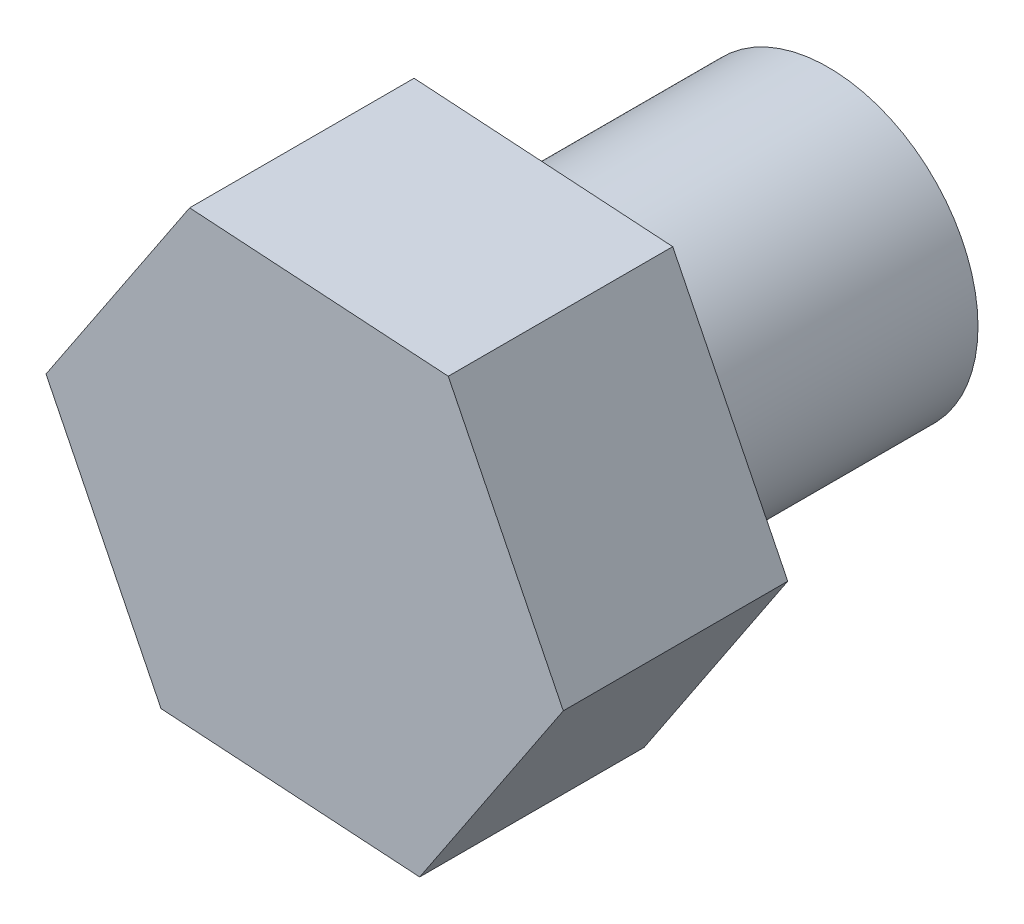
ISO-10303-21;
HEADER;
FILE_DESCRIPTION(('STEP AP214'),'2;1');
FILE_NAME('part.step','',(''),(''),'','','');
FILE_SCHEMA(('AUTOMOTIVE_DESIGN { 1 0 10303 214 1 1 1 1 }'));
ENDSEC;
DATA;
#1=APPLICATION_CONTEXT('core data for automotive mechanical design processes');
#2=APPLICATION_PROTOCOL_DEFINITION('international standard','automotive_design',2000,#1);
#3=PRODUCT_CONTEXT('',#1,'mechanical');
#4=PRODUCT('Part','Part','',(#3));
#5=PRODUCT_RELATED_PRODUCT_CATEGORY('part','',(#4));
#6=PRODUCT_DEFINITION_FORMATION('','',#4);
#7=PRODUCT_DEFINITION_CONTEXT('part definition',#1,'design');
#8=PRODUCT_DEFINITION('design','',#6,#7);
#9=PRODUCT_DEFINITION_SHAPE('','',#8);
#10=(LENGTH_UNIT() NAMED_UNIT(*) SI_UNIT(.MILLI.,.METRE.));
#11=(NAMED_UNIT(*) PLANE_ANGLE_UNIT() SI_UNIT($,.RADIAN.));
#12=(NAMED_UNIT(*) SI_UNIT($,.STERADIAN.) SOLID_ANGLE_UNIT());
#13=UNCERTAINTY_MEASURE_WITH_UNIT(LENGTH_MEASURE(1.E-05),#10,'distance_accuracy_value','');
#14=(GEOMETRIC_REPRESENTATION_CONTEXT(3) GLOBAL_UNCERTAINTY_ASSIGNED_CONTEXT((#13)) GLOBAL_UNIT_ASSIGNED_CONTEXT((#10,
#11,#12)) REPRESENTATION_CONTEXT('',''));
#15=CARTESIAN_POINT('',(0.,0.,0.));
#16=DIRECTION('',(0.,0.,1.));
#17=DIRECTION('',(1.,0.,0.));
#18=AXIS2_PLACEMENT_3D('',#15,#16,#17);
#19=CARTESIAN_POINT('',(1.53737826762693,-3.10426610686463,0.));
#20=DIRECTION('',(0.,0.,1.));
#21=DIRECTION('',(1.,0.,0.));
#22=AXIS2_PLACEMENT_3D('',#19,#20,#21);
#23=PLANE('',#22);
#24=DIRECTION('',(0.997967965881328,-0.0637176512018894,0.));
#25=VECTOR('',#24,1.);
#26=CARTESIAN_POINT('',(-1.91968417483831,-2.88354168842338,0.));
#27=LINE('',#26,#25);
#28=CARTESIAN_POINT('',(-1.91968417483831,-2.88354168842338,0.));
#29=VERTEX_POINT('',#28);
#30=CARTESIAN_POINT('',(1.53737826762693,-3.10426610686463,0.));
#31=VERTEX_POINT('',#30);
#32=EDGE_CURVE('E116',#29,#31,#27,.T.);
#33=ORIENTED_EDGE('',*,*,#32,.F.);
#34=DIRECTION('',(0.44380287833035,-0.896124436217257,0.));
#35=VECTOR('',#34,1.);
#36=CARTESIAN_POINT('',(-3.45706244246527,0.22072441844125,0.));
#37=LINE('',#36,#35);
#38=CARTESIAN_POINT('',(-3.45706244246527,0.22072441844125,0.));
#39=VERTEX_POINT('',#38);
#40=EDGE_CURVE('E76',#39,#29,#37,.T.);
#41=ORIENTED_EDGE('',*,*,#40,.F.);
#42=DIRECTION('',(-0.554165087550976,-0.832406785015366,0.));
#43=VECTOR('',#42,1.);
#44=CARTESIAN_POINT('',(-1.53737826762695,3.10426610686464,0.));
#45=LINE('',#44,#43);
#46=CARTESIAN_POINT('',(-1.53737826762695,3.10426610686464,0.));
#47=VERTEX_POINT('',#46);
#48=EDGE_CURVE('E70',#47,#39,#45,.T.);
#49=ORIENTED_EDGE('',*,*,#48,.F.);
#50=DIRECTION('',(-0.997967965881327,0.0637176512018897,0.));
#51=VECTOR('',#50,1.);
#52=CARTESIAN_POINT('',(1.91968417483827,2.88354168842339,0.));
#53=LINE('',#52,#51);
#54=CARTESIAN_POINT('',(1.91968417483827,2.88354168842339,0.));
#55=VERTEX_POINT('',#54);
#56=EDGE_CURVE('E106',#55,#47,#53,.T.);
#57=ORIENTED_EDGE('',*,*,#56,.F.);
#58=DIRECTION('',(-0.443802878330351,0.896124436217256,0.));
#59=VECTOR('',#58,1.);
#60=CARTESIAN_POINT('',(3.45706244246524,-0.220724418441245,0.));
#61=LINE('',#60,#59);
#62=CARTESIAN_POINT('',(3.45706244246524,-0.220724418441245,0.));
#63=VERTEX_POINT('',#62);
#64=EDGE_CURVE('E122',#63,#55,#61,.T.);
#65=ORIENTED_EDGE('',*,*,#64,.F.);
#66=DIRECTION('',(0.554165087550976,0.832406785015367,0.));
#67=VECTOR('',#66,1.);
#68=CARTESIAN_POINT('',(1.53737826762693,-3.10426610686463,0.));
#69=LINE('',#68,#67);
#70=EDGE_CURVE('E119',#31,#63,#69,.T.);
#71=ORIENTED_EDGE('',*,*,#70,.F.);
#72=EDGE_LOOP('',(#33,#41,#49,#57,#65,#71));
#73=FACE_BOUND('',#72,.T.);
#74=CARTESIAN_POINT('',(0.,0.,0.));
#75=DIRECTION('',(0.,0.,1.));
#76=DIRECTION('',(1.,0.,0.));
#77=AXIS2_PLACEMENT_3D('',#74,#75,#76);
#78=CIRCLE('',#77,2.);
#79=CARTESIAN_POINT('',(2.,0.,0.));
#80=VERTEX_POINT('',#79);
#81=EDGE_CURVE('E11',#80,#80,#78,.F.);
#82=ORIENTED_EDGE('',*,*,#81,.F.);
#83=EDGE_LOOP('',(#82));
#84=FACE_BOUND('',#83,.T.);
#85=ADVANCED_FACE('F30',(#73,#84),#23,.F.);
#86=CARTESIAN_POINT('',(-1.91968417483831,-2.88354168842338,3.));
#87=DIRECTION('',(0.0637176512018894,0.997967965881327,0.));
#88=DIRECTION('',(-0.997967965881328,0.0637176512018894,0.));
#89=AXIS2_PLACEMENT_3D('',#86,#87,#88);
#90=PLANE('',#89);
#91=ORIENTED_EDGE('',*,*,#32,.T.);
#92=DIRECTION('',(0.,0.,-1.));
#93=VECTOR('',#92,1.);
#94=CARTESIAN_POINT('',(1.53737826762693,-3.10426610686463,3.));
#95=LINE('',#94,#93);
#96=CARTESIAN_POINT('',(1.53737826762693,-3.10426610686463,3.));
#97=VERTEX_POINT('',#96);
#98=EDGE_CURVE('E39',#97,#31,#95,.T.);
#99=ORIENTED_EDGE('',*,*,#98,.F.);
#100=DIRECTION('',(0.997967965881328,-0.0637176512018894,0.));
#101=VECTOR('',#100,1.);
#102=CARTESIAN_POINT('',(-1.91968417483831,-2.88354168842338,3.));
#103=LINE('',#102,#101);
#104=CARTESIAN_POINT('',(-1.91968417483831,-2.88354168842338,3.));
#105=VERTEX_POINT('',#104);
#106=EDGE_CURVE('E127',#105,#97,#103,.T.);
#107=ORIENTED_EDGE('',*,*,#106,.F.);
#108=DIRECTION('',(0.,0.,-1.));
#109=VECTOR('',#108,1.);
#110=CARTESIAN_POINT('',(-1.91968417483831,-2.88354168842338,3.));
#111=LINE('',#110,#109);
#112=EDGE_CURVE('E112',#105,#29,#111,.T.);
#113=ORIENTED_EDGE('',*,*,#112,.T.);
#114=EDGE_LOOP('',(#91,#99,#107,#113));
#115=FACE_BOUND('',#114,.T.);
#116=ADVANCED_FACE('F32',(#115),#90,.F.);
#117=CARTESIAN_POINT('',(1.53737826762693,-3.10426610686463,3.));
#118=DIRECTION('',(-0.832406785015367,0.554165087550976,0.));
#119=DIRECTION('',(-0.554165087550976,-0.832406785015367,0.));
#120=AXIS2_PLACEMENT_3D('',#117,#118,#119);
#121=PLANE('',#120);
#122=ORIENTED_EDGE('',*,*,#70,.T.);
#123=DIRECTION('',(0.,0.,-1.));
#124=VECTOR('',#123,1.);
#125=CARTESIAN_POINT('',(3.45706244246524,-0.220724418441245,3.));
#126=LINE('',#125,#124);
#127=CARTESIAN_POINT('',(3.45706244246524,-0.220724418441245,3.));
#128=VERTEX_POINT('',#127);
#129=EDGE_CURVE('E131',#128,#63,#126,.T.);
#130=ORIENTED_EDGE('',*,*,#129,.F.);
#131=DIRECTION('',(0.554165087550976,0.832406785015367,0.));
#132=VECTOR('',#131,1.);
#133=CARTESIAN_POINT('',(1.53737826762693,-3.10426610686463,3.));
#134=LINE('',#133,#132);
#135=EDGE_CURVE('E85',#97,#128,#134,.T.);
#136=ORIENTED_EDGE('',*,*,#135,.F.);
#137=ORIENTED_EDGE('',*,*,#98,.T.);
#138=EDGE_LOOP('',(#122,#130,#136,#137));
#139=FACE_BOUND('',#138,.T.);
#140=ADVANCED_FACE('F134',(#139),#121,.F.);
#141=CARTESIAN_POINT('',(3.45706244246524,-0.220724418441245,3.));
#142=DIRECTION('',(-0.896124436217256,-0.443802878330351,0.));
#143=DIRECTION('',(0.443802878330351,-0.896124436217256,0.));
#144=AXIS2_PLACEMENT_3D('',#141,#142,#143);
#145=PLANE('',#144);
#146=ORIENTED_EDGE('',*,*,#64,.T.);
#147=DIRECTION('',(0.,0.,-1.));
#148=VECTOR('',#147,1.);
#149=CARTESIAN_POINT('',(1.91968417483827,2.88354168842339,3.));
#150=LINE('',#149,#148);
#151=CARTESIAN_POINT('',(1.91968417483827,2.88354168842339,3.));
#152=VERTEX_POINT('',#151);
#153=EDGE_CURVE('E107',#152,#55,#150,.T.);
#154=ORIENTED_EDGE('',*,*,#153,.F.);
#155=DIRECTION('',(-0.443802878330351,0.896124436217256,0.));
#156=VECTOR('',#155,1.);
#157=CARTESIAN_POINT('',(3.45706244246524,-0.220724418441245,3.));
#158=LINE('',#157,#156);
#159=EDGE_CURVE('E98',#128,#152,#158,.T.);
#160=ORIENTED_EDGE('',*,*,#159,.F.);
#161=ORIENTED_EDGE('',*,*,#129,.T.);
#162=EDGE_LOOP('',(#146,#154,#160,#161));
#163=FACE_BOUND('',#162,.T.);
#164=ADVANCED_FACE('F142',(#163),#145,.F.);
#165=CARTESIAN_POINT('',(1.91968417483827,2.88354168842339,3.));
#166=DIRECTION('',(-0.0637176512018897,-0.997967965881328,0.));
#167=DIRECTION('',(0.997967965881328,-0.0637176512018897,0.));
#168=AXIS2_PLACEMENT_3D('',#165,#166,#167);
#169=PLANE('',#168);
#170=ORIENTED_EDGE('',*,*,#56,.T.);
#171=DIRECTION('',(0.,0.,-1.));
#172=VECTOR('',#171,1.);
#173=CARTESIAN_POINT('',(-1.53737826762695,3.10426610686464,3.));
#174=LINE('',#173,#172);
#175=CARTESIAN_POINT('',(-1.53737826762695,3.10426610686464,3.));
#176=VERTEX_POINT('',#175);
#177=EDGE_CURVE('E103',#176,#47,#174,.T.);
#178=ORIENTED_EDGE('',*,*,#177,.F.);
#179=DIRECTION('',(-0.997967965881327,0.0637176512018897,0.));
#180=VECTOR('',#179,1.);
#181=CARTESIAN_POINT('',(1.91968417483827,2.88354168842339,3.));
#182=LINE('',#181,#180);
#183=EDGE_CURVE('E92',#152,#176,#182,.T.);
#184=ORIENTED_EDGE('',*,*,#183,.F.);
#185=ORIENTED_EDGE('',*,*,#153,.T.);
#186=EDGE_LOOP('',(#170,#178,#184,#185));
#187=FACE_BOUND('',#186,.T.);
#188=ADVANCED_FACE('F104',(#187),#169,.F.);
#189=CARTESIAN_POINT('',(-1.53737826762695,3.10426610686464,3.));
#190=DIRECTION('',(0.832406785015366,-0.554165087550977,0.));
#191=DIRECTION('',(0.554165087550977,0.832406785015367,0.));
#192=AXIS2_PLACEMENT_3D('',#189,#190,#191);
#193=PLANE('',#192);
#194=ORIENTED_EDGE('',*,*,#48,.T.);
#195=DIRECTION('',(0.,0.,-1.));
#196=VECTOR('',#195,1.);
#197=CARTESIAN_POINT('',(-3.45706244246527,0.22072441844125,3.));
#198=LINE('',#197,#196);
#199=CARTESIAN_POINT('',(-3.45706244246527,0.22072441844125,3.));
#200=VERTEX_POINT('',#199);
#201=EDGE_CURVE('E108',#200,#39,#198,.T.);
#202=ORIENTED_EDGE('',*,*,#201,.F.);
#203=DIRECTION('',(-0.554165087550976,-0.832406785015366,0.));
#204=VECTOR('',#203,1.);
#205=CARTESIAN_POINT('',(-1.53737826762695,3.10426610686464,3.));
#206=LINE('',#205,#204);
#207=EDGE_CURVE('E96',#176,#200,#206,.T.);
#208=ORIENTED_EDGE('',*,*,#207,.F.);
#209=ORIENTED_EDGE('',*,*,#177,.T.);
#210=EDGE_LOOP('',(#194,#202,#208,#209));
#211=FACE_BOUND('',#210,.T.);
#212=ADVANCED_FACE('F110',(#211),#193,.F.);
#213=CARTESIAN_POINT('',(-3.45706244246527,0.22072441844125,3.));
#214=DIRECTION('',(0.896124436217257,0.44380287833035,0.));
#215=DIRECTION('',(-0.44380287833035,0.896124436217257,0.));
#216=AXIS2_PLACEMENT_3D('',#213,#214,#215);
#217=PLANE('',#216);
#218=ORIENTED_EDGE('',*,*,#40,.T.);
#219=ORIENTED_EDGE('',*,*,#112,.F.);
#220=DIRECTION('',(0.44380287833035,-0.896124436217257,0.));
#221=VECTOR('',#220,1.);
#222=CARTESIAN_POINT('',(-3.45706244246527,0.22072441844125,3.));
#223=LINE('',#222,#221);
#224=EDGE_CURVE('E47',#200,#105,#223,.T.);
#225=ORIENTED_EDGE('',*,*,#224,.F.);
#226=ORIENTED_EDGE('',*,*,#201,.T.);
#227=EDGE_LOOP('',(#218,#219,#225,#226));
#228=FACE_BOUND('',#227,.T.);
#229=ADVANCED_FACE('F163',(#228),#217,.F.);
#230=CARTESIAN_POINT('',(1.53737826762693,-3.10426610686463,3.));
#231=DIRECTION('',(0.,0.,1.));
#232=DIRECTION('',(1.,0.,0.));
#233=AXIS2_PLACEMENT_3D('',#230,#231,#232);
#234=PLANE('',#233);
#235=ORIENTED_EDGE('',*,*,#106,.T.);
#236=ORIENTED_EDGE('',*,*,#135,.T.);
#237=ORIENTED_EDGE('',*,*,#159,.T.);
#238=ORIENTED_EDGE('',*,*,#183,.T.);
#239=ORIENTED_EDGE('',*,*,#207,.T.);
#240=ORIENTED_EDGE('',*,*,#224,.T.);
#241=EDGE_LOOP('',(#235,#236,#237,#238,#239,#240));
#242=FACE_BOUND('',#241,.T.);
#243=ADVANCED_FACE('F94',(#242),#234,.T.);
#244=CARTESIAN_POINT('',(0.,0.,-4.));
#245=DIRECTION('',(0.,0.,1.));
#246=DIRECTION('',(1.,0.,0.));
#247=AXIS2_PLACEMENT_3D('',#244,#245,#246);
#248=CYLINDRICAL_SURFACE('',#247,2.);
#249=CARTESIAN_POINT('',(0.,0.,-4.));
#250=DIRECTION('',(0.,0.,-1.));
#251=DIRECTION('',(-1.,0.,0.));
#252=AXIS2_PLACEMENT_3D('',#249,#250,#251);
#253=CIRCLE('',#252,2.);
#254=CARTESIAN_POINT('',(-2.,0.,-4.));
#255=VERTEX_POINT('',#254);
#256=EDGE_CURVE('E120',#255,#255,#253,.T.);
#257=ORIENTED_EDGE('',*,*,#256,.F.);
#258=EDGE_LOOP('',(#257));
#259=FACE_BOUND('',#258,.T.);
#260=ORIENTED_EDGE('',*,*,#81,.T.);
#261=EDGE_LOOP('',(#260));
#262=FACE_BOUND('',#261,.T.);
#263=ADVANCED_FACE('F151',(#259,#262),#248,.T.);
#264=CARTESIAN_POINT('',(0.,0.,-4.));
#265=DIRECTION('',(0.,0.,-1.));
#266=DIRECTION('',(-1.,0.,0.));
#267=AXIS2_PLACEMENT_3D('',#264,#265,#266);
#268=PLANE('',#267);
#269=ORIENTED_EDGE('',*,*,#256,.T.);
#270=EDGE_LOOP('',(#269));
#271=FACE_BOUND('',#270,.T.);
#272=ADVANCED_FACE('F149',(#271),#268,.T.);
#273=CLOSED_SHELL('',(#85,#116,#140,#164,#188,#212,#229,#243,#263,#272));
#274=MANIFOLD_SOLID_BREP('B2',#273);
#275=ADVANCED_BREP_SHAPE_REPRESENTATION('',(#18,#274),#14);
#276=SHAPE_DEFINITION_REPRESENTATION(#9,#275);
ENDSEC;
END-ISO-10303-21;
